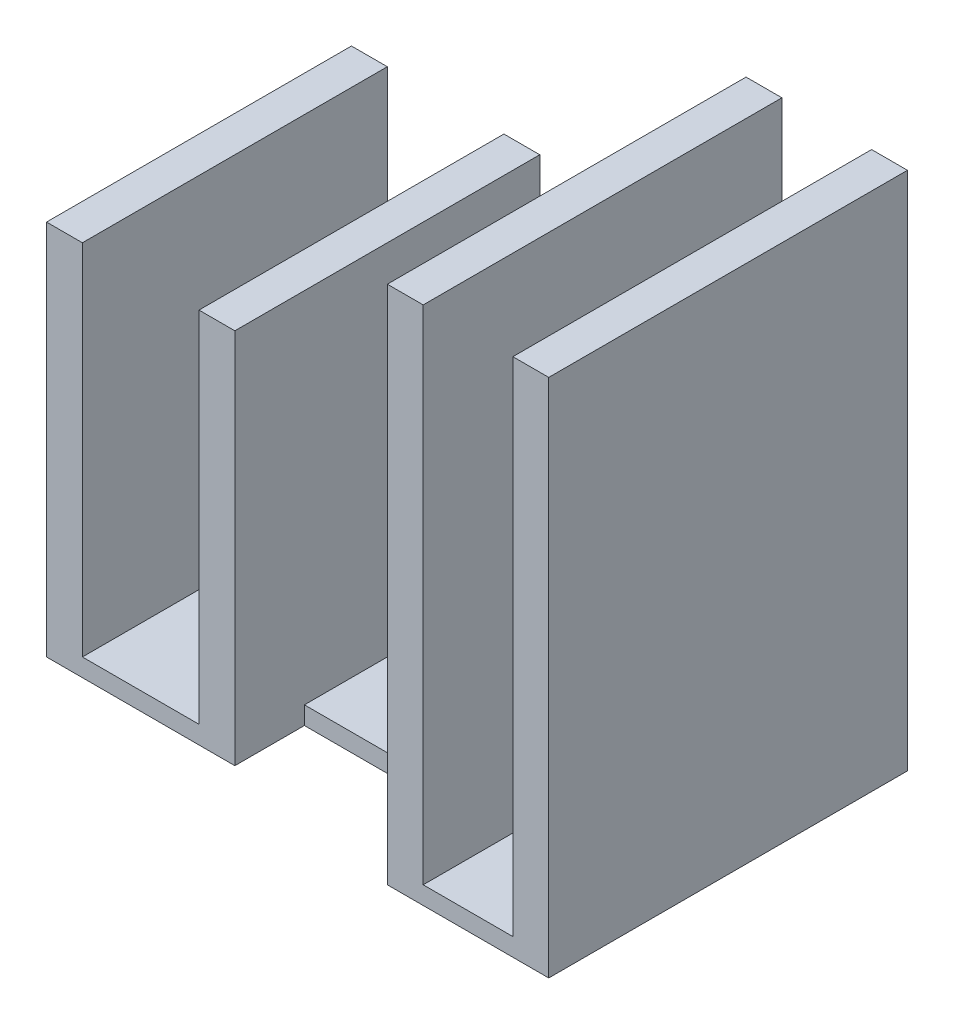
ISO-10303-21;
HEADER;
FILE_DESCRIPTION(('STEP AP214'),'2;1');
FILE_NAME('part.step','',(''),(''),'','','');
FILE_SCHEMA(('AUTOMOTIVE_DESIGN { 1 0 10303 214 1 1 1 1 }'));
ENDSEC;
DATA;
#1=APPLICATION_CONTEXT('core data for automotive mechanical design processes');
#2=APPLICATION_PROTOCOL_DEFINITION('international standard','automotive_design',2000,#1);
#3=PRODUCT_CONTEXT('',#1,'mechanical');
#4=PRODUCT('Part','Part','',(#3));
#5=PRODUCT_RELATED_PRODUCT_CATEGORY('part','',(#4));
#6=PRODUCT_DEFINITION_FORMATION('','',#4);
#7=PRODUCT_DEFINITION_CONTEXT('part definition',#1,'design');
#8=PRODUCT_DEFINITION('design','',#6,#7);
#9=PRODUCT_DEFINITION_SHAPE('','',#8);
#10=(LENGTH_UNIT() NAMED_UNIT(*) SI_UNIT(.MILLI.,.METRE.));
#11=(NAMED_UNIT(*) PLANE_ANGLE_UNIT() SI_UNIT($,.RADIAN.));
#12=(NAMED_UNIT(*) SI_UNIT($,.STERADIAN.) SOLID_ANGLE_UNIT());
#13=UNCERTAINTY_MEASURE_WITH_UNIT(LENGTH_MEASURE(1.E-05),#10,'distance_accuracy_value','');
#14=(GEOMETRIC_REPRESENTATION_CONTEXT(3) GLOBAL_UNCERTAINTY_ASSIGNED_CONTEXT((#13)) GLOBAL_UNIT_ASSIGNED_CONTEXT((#10,
#11,#12)) REPRESENTATION_CONTEXT('',''));
#15=CARTESIAN_POINT('',(0.,0.,0.));
#16=DIRECTION('',(0.,0.,1.));
#17=DIRECTION('',(1.,0.,0.));
#18=AXIS2_PLACEMENT_3D('',#15,#16,#17);
#19=CARTESIAN_POINT('',(0.,0.,0.));
#20=DIRECTION('',(0.,-1.,0.));
#21=DIRECTION('',(0.,0.,-1.));
#22=AXIS2_PLACEMENT_3D('',#19,#20,#21);
#23=PLANE('',#22);
#24=DIRECTION('',(1.,0.,0.));
#25=VECTOR('',#24,1.);
#26=CARTESIAN_POINT('',(0.,0.,4.62214276562588));
#27=LINE('',#26,#25);
#28=CARTESIAN_POINT('',(2.,0.,4.62214276562588));
#29=VERTEX_POINT('',#28);
#30=CARTESIAN_POINT('',(12.,0.,4.62214276562588));
#31=VERTEX_POINT('',#30);
#32=EDGE_CURVE('E264',#29,#31,#27,.T.);
#33=ORIENTED_EDGE('',*,*,#32,.T.);
#34=DIRECTION('',(0.,0.,-1.));
#35=VECTOR('',#34,1.);
#36=CARTESIAN_POINT('',(12.,0.,0.));
#37=LINE('',#36,#35);
#38=CARTESIAN_POINT('',(12.,0.,-3.51282850187557));
#39=VERTEX_POINT('',#38);
#40=EDGE_CURVE('E331',#31,#39,#37,.T.);
#41=ORIENTED_EDGE('',*,*,#40,.T.);
#42=DIRECTION('',(1.,0.,0.));
#43=VECTOR('',#42,1.);
#44=CARTESIAN_POINT('',(0.,0.,-3.51282850187557));
#45=LINE('',#44,#43);
#46=CARTESIAN_POINT('',(2.,0.,-3.51282850187557));
#47=VERTEX_POINT('',#46);
#48=EDGE_CURVE('E204',#47,#39,#45,.T.);
#49=ORIENTED_EDGE('',*,*,#48,.F.);
#50=DIRECTION('',(0.,0.,1.));
#51=VECTOR('',#50,1.);
#52=CARTESIAN_POINT('',(2.,0.,-8.5));
#53=LINE('',#52,#51);
#54=EDGE_CURVE('E298',#47,#29,#53,.T.);
#55=ORIENTED_EDGE('',*,*,#54,.T.);
#56=EDGE_LOOP('',(#33,#41,#49,#55));
#57=FACE_BOUND('',#56,.T.);
#58=ADVANCED_FACE('F81',(#57),#23,.F.);
#59=DIRECTION('',(0.,0.,1.));
#60=VECTOR('',#59,1.);
#61=CARTESIAN_POINT('',(0.,0.,-8.5));
#62=LINE('',#61,#60);
#63=CARTESIAN_POINT('',(0.,0.,-8.5));
#64=VERTEX_POINT('',#63);
#65=CARTESIAN_POINT('',(0.,0.,8.5));
#66=VERTEX_POINT('',#65);
#67=EDGE_CURVE('E182',#64,#66,#62,.T.);
#68=ORIENTED_EDGE('',*,*,#67,.F.);
#69=DIRECTION('',(-1.,0.,0.));
#70=VECTOR('',#69,1.);
#71=CARTESIAN_POINT('',(2.,0.,-8.5));
#72=LINE('',#71,#70);
#73=CARTESIAN_POINT('',(-6.5,0.,-8.5));
#74=VERTEX_POINT('',#73);
#75=EDGE_CURVE('E120',#64,#74,#72,.T.);
#76=ORIENTED_EDGE('',*,*,#75,.T.);
#77=DIRECTION('',(0.,0.,1.));
#78=VECTOR('',#77,1.);
#79=CARTESIAN_POINT('',(-6.5,0.,0.));
#80=LINE('',#79,#78);
#81=CARTESIAN_POINT('',(-6.5,0.,8.5));
#82=VERTEX_POINT('',#81);
#83=EDGE_CURVE('E170',#74,#82,#80,.T.);
#84=ORIENTED_EDGE('',*,*,#83,.T.);
#85=DIRECTION('',(-1.,0.,0.));
#86=VECTOR('',#85,1.);
#87=CARTESIAN_POINT('',(2.,0.,8.5));
#88=LINE('',#87,#86);
#89=EDGE_CURVE('E129',#66,#82,#88,.T.);
#90=ORIENTED_EDGE('',*,*,#89,.F.);
#91=EDGE_LOOP('',(#68,#76,#84,#90));
#92=FACE_BOUND('',#91,.T.);
#93=ADVANCED_FACE('F178',(#92),#23,.F.);
#94=DIRECTION('',(-1.,0.,0.));
#95=VECTOR('',#94,1.);
#96=CARTESIAN_POINT('',(0.,0.,-10.));
#97=LINE('',#96,#95);
#98=CARTESIAN_POINT('',(19.,0.,-10.));
#99=VERTEX_POINT('',#98);
#100=CARTESIAN_POINT('',(14.,0.,-10.));
#101=VERTEX_POINT('',#100);
#102=EDGE_CURVE('E272',#99,#101,#97,.T.);
#103=ORIENTED_EDGE('',*,*,#102,.T.);
#104=DIRECTION('',(0.,0.,1.));
#105=VECTOR('',#104,1.);
#106=CARTESIAN_POINT('',(14.,0.,-10.));
#107=LINE('',#106,#105);
#108=CARTESIAN_POINT('',(14.,0.,10.));
#109=VERTEX_POINT('',#108);
#110=EDGE_CURVE('E325',#101,#109,#107,.T.);
#111=ORIENTED_EDGE('',*,*,#110,.T.);
#112=DIRECTION('',(-1.,0.,0.));
#113=VECTOR('',#112,1.);
#114=CARTESIAN_POINT('',(0.,0.,10.));
#115=LINE('',#114,#113);
#116=CARTESIAN_POINT('',(19.,0.,10.));
#117=VERTEX_POINT('',#116);
#118=EDGE_CURVE('E268',#117,#109,#115,.T.);
#119=ORIENTED_EDGE('',*,*,#118,.F.);
#120=DIRECTION('',(0.,0.,1.));
#121=VECTOR('',#120,1.);
#122=CARTESIAN_POINT('',(19.,0.,0.));
#123=LINE('',#122,#121);
#124=EDGE_CURVE('E97',#99,#117,#123,.T.);
#125=ORIENTED_EDGE('',*,*,#124,.F.);
#126=EDGE_LOOP('',(#103,#111,#119,#125));
#127=FACE_BOUND('',#126,.T.);
#128=ADVANCED_FACE('F501',(#127),#23,.F.);
#129=CARTESIAN_POINT('',(0.,20.,-8.5));
#130=DIRECTION('',(0.,0.,1.));
#131=DIRECTION('',(1.,0.,0.));
#132=AXIS2_PLACEMENT_3D('',#129,#130,#131);
#133=PLANE('',#132);
#134=DIRECTION('',(0.,-1.,0.));
#135=VECTOR('',#134,1.);
#136=CARTESIAN_POINT('',(-6.5,20.,-8.5));
#137=LINE('',#136,#135);
#138=CARTESIAN_POINT('',(-6.5,20.,-8.5));
#139=VERTEX_POINT('',#138);
#140=EDGE_CURVE('E106',#139,#74,#137,.T.);
#141=ORIENTED_EDGE('',*,*,#140,.T.);
#142=ORIENTED_EDGE('',*,*,#75,.F.);
#143=DIRECTION('',(0.,-1.,0.));
#144=VECTOR('',#143,1.);
#145=CARTESIAN_POINT('',(0.,20.,-8.5));
#146=LINE('',#145,#144);
#147=CARTESIAN_POINT('',(0.,20.,-8.5));
#148=VERTEX_POINT('',#147);
#149=EDGE_CURVE('E321',#148,#64,#146,.T.);
#150=ORIENTED_EDGE('',*,*,#149,.F.);
#151=DIRECTION('',(1.,0.,0.));
#152=VECTOR('',#151,1.);
#153=CARTESIAN_POINT('',(0.,20.,-8.5));
#154=LINE('',#153,#152);
#155=CARTESIAN_POINT('',(2.,20.,-8.5));
#156=VERTEX_POINT('',#155);
#157=EDGE_CURVE('E299',#148,#156,#154,.T.);
#158=ORIENTED_EDGE('',*,*,#157,.T.);
#159=DIRECTION('',(0.,1.,0.));
#160=VECTOR('',#159,1.);
#161=CARTESIAN_POINT('',(2.,-1.,-8.5));
#162=LINE('',#161,#160);
#163=CARTESIAN_POINT('',(2.,-1.,-8.5));
#164=VERTEX_POINT('',#163);
#165=EDGE_CURVE('E201',#164,#156,#162,.T.);
#166=ORIENTED_EDGE('',*,*,#165,.F.);
#167=DIRECTION('',(-1.,0.,0.));
#168=VECTOR('',#167,1.);
#169=CARTESIAN_POINT('',(2.,-1.,-8.5));
#170=LINE('',#169,#168);
#171=CARTESIAN_POINT('',(-8.49999999999999,-1.,-8.5));
#172=VERTEX_POINT('',#171);
#173=EDGE_CURVE('E285',#164,#172,#170,.T.);
#174=ORIENTED_EDGE('',*,*,#173,.T.);
#175=DIRECTION('',(0.,-1.,0.));
#176=VECTOR('',#175,1.);
#177=CARTESIAN_POINT('',(-8.5,20.,-8.5));
#178=LINE('',#177,#176);
#179=CARTESIAN_POINT('',(-8.5,20.,-8.5));
#180=VERTEX_POINT('',#179);
#181=EDGE_CURVE('E12',#180,#172,#178,.T.);
#182=ORIENTED_EDGE('',*,*,#181,.F.);
#183=DIRECTION('',(-1.,0.,0.));
#184=VECTOR('',#183,1.);
#185=CARTESIAN_POINT('',(0.,20.,-8.5));
#186=LINE('',#185,#184);
#187=EDGE_CURVE('E147',#139,#180,#186,.T.);
#188=ORIENTED_EDGE('',*,*,#187,.F.);
#189=EDGE_LOOP('',(#141,#142,#150,#158,#166,#174,#182,#188));
#190=FACE_BOUND('',#189,.T.);
#191=ADVANCED_FACE('F83',(#190),#133,.F.);
#192=CARTESIAN_POINT('',(-8.5,20.,0.));
#193=DIRECTION('',(1.,0.,0.));
#194=DIRECTION('',(0.,0.,-1.));
#195=AXIS2_PLACEMENT_3D('',#192,#193,#194);
#196=PLANE('',#195);
#197=ORIENTED_EDGE('',*,*,#181,.T.);
#198=DIRECTION('',(0.,0.,1.));
#199=VECTOR('',#198,1.);
#200=CARTESIAN_POINT('',(-8.49999999999999,-1.,-8.5));
#201=LINE('',#200,#199);
#202=CARTESIAN_POINT('',(-8.49999999999999,-1.,8.5));
#203=VERTEX_POINT('',#202);
#204=EDGE_CURVE('E157',#172,#203,#201,.T.);
#205=ORIENTED_EDGE('',*,*,#204,.T.);
#206=DIRECTION('',(0.,-1.,0.));
#207=VECTOR('',#206,1.);
#208=CARTESIAN_POINT('',(-8.49999999999999,20.,8.5));
#209=LINE('',#208,#207);
#210=CARTESIAN_POINT('',(-8.49999999999999,20.,8.5));
#211=VERTEX_POINT('',#210);
#212=EDGE_CURVE('E90',#211,#203,#209,.T.);
#213=ORIENTED_EDGE('',*,*,#212,.F.);
#214=DIRECTION('',(0.,0.,1.));
#215=VECTOR('',#214,1.);
#216=CARTESIAN_POINT('',(-8.5,20.,0.));
#217=LINE('',#216,#215);
#218=EDGE_CURVE('E141',#180,#211,#217,.T.);
#219=ORIENTED_EDGE('',*,*,#218,.F.);
#220=EDGE_LOOP('',(#197,#205,#213,#219));
#221=FACE_BOUND('',#220,.T.);
#222=ADVANCED_FACE('F154',(#221),#196,.F.);
#223=CARTESIAN_POINT('',(0.,20.,8.5));
#224=DIRECTION('',(0.,0.,1.));
#225=DIRECTION('',(1.,0.,0.));
#226=AXIS2_PLACEMENT_3D('',#223,#224,#225);
#227=PLANE('',#226);
#228=ORIENTED_EDGE('',*,*,#212,.T.);
#229=DIRECTION('',(-1.,0.,0.));
#230=VECTOR('',#229,1.);
#231=CARTESIAN_POINT('',(2.,-1.,8.5));
#232=LINE('',#231,#230);
#233=CARTESIAN_POINT('',(2.,-1.,8.5));
#234=VERTEX_POINT('',#233);
#235=EDGE_CURVE('E189',#234,#203,#232,.T.);
#236=ORIENTED_EDGE('',*,*,#235,.F.);
#237=DIRECTION('',(0.,1.,0.));
#238=VECTOR('',#237,1.);
#239=CARTESIAN_POINT('',(2.,-1.,8.5));
#240=LINE('',#239,#238);
#241=CARTESIAN_POINT('',(1.99999999999999,20.,8.5));
#242=VERTEX_POINT('',#241);
#243=EDGE_CURVE('E197',#234,#242,#240,.T.);
#244=ORIENTED_EDGE('',*,*,#243,.T.);
#245=DIRECTION('',(1.,0.,0.));
#246=VECTOR('',#245,1.);
#247=CARTESIAN_POINT('',(0.,20.,8.5));
#248=LINE('',#247,#246);
#249=CARTESIAN_POINT('',(0.,20.,8.5));
#250=VERTEX_POINT('',#249);
#251=EDGE_CURVE('E307',#250,#242,#248,.T.);
#252=ORIENTED_EDGE('',*,*,#251,.F.);
#253=DIRECTION('',(0.,-1.,0.));
#254=VECTOR('',#253,1.);
#255=CARTESIAN_POINT('',(0.,20.,8.5));
#256=LINE('',#255,#254);
#257=EDGE_CURVE('E315',#250,#66,#256,.T.);
#258=ORIENTED_EDGE('',*,*,#257,.T.);
#259=ORIENTED_EDGE('',*,*,#89,.T.);
#260=DIRECTION('',(0.,-1.,0.));
#261=VECTOR('',#260,1.);
#262=CARTESIAN_POINT('',(-6.5,20.,8.5));
#263=LINE('',#262,#261);
#264=CARTESIAN_POINT('',(-6.5,20.,8.5));
#265=VERTEX_POINT('',#264);
#266=EDGE_CURVE('E161',#265,#82,#263,.T.);
#267=ORIENTED_EDGE('',*,*,#266,.F.);
#268=DIRECTION('',(-1.,0.,0.));
#269=VECTOR('',#268,1.);
#270=CARTESIAN_POINT('',(0.,20.,8.5));
#271=LINE('',#270,#269);
#272=EDGE_CURVE('E146',#265,#211,#271,.T.);
#273=ORIENTED_EDGE('',*,*,#272,.T.);
#274=EDGE_LOOP('',(#228,#236,#244,#252,#258,#259,#267,#273));
#275=FACE_BOUND('',#274,.T.);
#276=ADVANCED_FACE('F162',(#275),#227,.T.);
#277=CARTESIAN_POINT('',(-6.5,20.,0.));
#278=DIRECTION('',(1.,0.,0.));
#279=DIRECTION('',(0.,0.,-1.));
#280=AXIS2_PLACEMENT_3D('',#277,#278,#279);
#281=PLANE('',#280);
#282=ORIENTED_EDGE('',*,*,#83,.F.);
#283=ORIENTED_EDGE('',*,*,#140,.F.);
#284=DIRECTION('',(0.,0.,1.));
#285=VECTOR('',#284,1.);
#286=CARTESIAN_POINT('',(-6.5,20.,0.));
#287=LINE('',#286,#285);
#288=EDGE_CURVE('E164',#139,#265,#287,.T.);
#289=ORIENTED_EDGE('',*,*,#288,.T.);
#290=ORIENTED_EDGE('',*,*,#266,.T.);
#291=EDGE_LOOP('',(#282,#283,#289,#290));
#292=FACE_BOUND('',#291,.T.);
#293=ADVANCED_FACE('F177',(#292),#281,.T.);
#294=CARTESIAN_POINT('',(0.,20.,0.));
#295=DIRECTION('',(0.,1.,0.));
#296=DIRECTION('',(0.,0.,1.));
#297=AXIS2_PLACEMENT_3D('',#294,#295,#296);
#298=PLANE('',#297);
#299=ORIENTED_EDGE('',*,*,#187,.T.);
#300=ORIENTED_EDGE('',*,*,#218,.T.);
#301=ORIENTED_EDGE('',*,*,#272,.F.);
#302=ORIENTED_EDGE('',*,*,#288,.F.);
#303=EDGE_LOOP('',(#299,#300,#301,#302));
#304=FACE_BOUND('',#303,.T.);
#305=ADVANCED_FACE('F143',(#304),#298,.T.);
#306=CARTESIAN_POINT('',(0.,-1.,-3.51282850187557));
#307=DIRECTION('',(0.,0.,1.));
#308=DIRECTION('',(1.,0.,0.));
#309=AXIS2_PLACEMENT_3D('',#306,#307,#308);
#310=PLANE('',#309);
#311=ORIENTED_EDGE('',*,*,#48,.T.);
#312=DIRECTION('',(0.,1.,0.));
#313=VECTOR('',#312,1.);
#314=CARTESIAN_POINT('',(12.,-1.,-3.51282850187557));
#315=LINE('',#314,#313);
#316=CARTESIAN_POINT('',(12.,-1.,-3.51282850187557));
#317=VERTEX_POINT('',#316);
#318=EDGE_CURVE('E209',#317,#39,#315,.T.);
#319=ORIENTED_EDGE('',*,*,#318,.F.);
#320=DIRECTION('',(1.,0.,0.));
#321=VECTOR('',#320,1.);
#322=CARTESIAN_POINT('',(0.,-1.,-3.51282850187557));
#323=LINE('',#322,#321);
#324=CARTESIAN_POINT('',(2.,-1.,-3.51282850187557));
#325=VERTEX_POINT('',#324);
#326=EDGE_CURVE('E261',#325,#317,#323,.T.);
#327=ORIENTED_EDGE('',*,*,#326,.F.);
#328=DIRECTION('',(0.,1.,0.));
#329=VECTOR('',#328,1.);
#330=CARTESIAN_POINT('',(2.,-1.,-3.51282850187557));
#331=LINE('',#330,#329);
#332=EDGE_CURVE('E173',#325,#47,#331,.T.);
#333=ORIENTED_EDGE('',*,*,#332,.T.);
#334=EDGE_LOOP('',(#311,#319,#327,#333));
#335=FACE_BOUND('',#334,.T.);
#336=ADVANCED_FACE('F491',(#335),#310,.F.);
#337=CARTESIAN_POINT('',(12.,-1.,0.));
#338=DIRECTION('',(1.,0.,0.));
#339=DIRECTION('',(0.,0.,-1.));
#340=AXIS2_PLACEMENT_3D('',#337,#338,#339);
#341=PLANE('',#340);
#342=ORIENTED_EDGE('',*,*,#318,.T.);
#343=ORIENTED_EDGE('',*,*,#40,.F.);
#344=DIRECTION('',(0.,1.,0.));
#345=VECTOR('',#344,1.);
#346=CARTESIAN_POINT('',(12.,-1.,4.62214276562588));
#347=LINE('',#346,#345);
#348=CARTESIAN_POINT('',(12.,-1.,4.62214276562588));
#349=VERTEX_POINT('',#348);
#350=EDGE_CURVE('E229',#349,#31,#347,.T.);
#351=ORIENTED_EDGE('',*,*,#350,.F.);
#352=DIRECTION('',(0.,0.,-1.));
#353=VECTOR('',#352,1.);
#354=CARTESIAN_POINT('',(12.,-1.,0.));
#355=LINE('',#354,#353);
#356=CARTESIAN_POINT('',(12.,-1.,10.));
#357=VERTEX_POINT('',#356);
#358=EDGE_CURVE('E241',#357,#349,#355,.T.);
#359=ORIENTED_EDGE('',*,*,#358,.F.);
#360=DIRECTION('',(0.,1.,0.));
#361=VECTOR('',#360,1.);
#362=CARTESIAN_POINT('',(12.,-1.,10.));
#363=LINE('',#362,#361);
#364=CARTESIAN_POINT('',(12.,28.,10.));
#365=VERTEX_POINT('',#364);
#366=EDGE_CURVE('E225',#357,#365,#363,.T.);
#367=ORIENTED_EDGE('',*,*,#366,.T.);
#368=DIRECTION('',(0.,0.,1.));
#369=VECTOR('',#368,1.);
#370=CARTESIAN_POINT('',(12.,28.,-10.));
#371=LINE('',#370,#369);
#372=CARTESIAN_POINT('',(12.,28.,-10.));
#373=VERTEX_POINT('',#372);
#374=EDGE_CURVE('E355',#373,#365,#371,.T.);
#375=ORIENTED_EDGE('',*,*,#374,.F.);
#376=DIRECTION('',(0.,1.,0.));
#377=VECTOR('',#376,1.);
#378=CARTESIAN_POINT('',(12.,-1.,-10.));
#379=LINE('',#378,#377);
#380=CARTESIAN_POINT('',(12.,-1.,-10.));
#381=VERTEX_POINT('',#380);
#382=EDGE_CURVE('E213',#381,#373,#379,.T.);
#383=ORIENTED_EDGE('',*,*,#382,.F.);
#384=EDGE_CURVE('E247',#317,#381,#355,.T.);
#385=ORIENTED_EDGE('',*,*,#384,.F.);
#386=EDGE_LOOP('',(#342,#343,#351,#359,#367,#375,#383,#385));
#387=FACE_BOUND('',#386,.T.);
#388=ADVANCED_FACE('F419',(#387),#341,.F.);
#389=CARTESIAN_POINT('',(0.,-1.,-10.));
#390=DIRECTION('',(0.,0.,-1.));
#391=DIRECTION('',(-1.,0.,0.));
#392=AXIS2_PLACEMENT_3D('',#389,#390,#391);
#393=PLANE('',#392);
#394=ORIENTED_EDGE('',*,*,#102,.F.);
#395=DIRECTION('',(0.,-1.,0.));
#396=VECTOR('',#395,1.);
#397=CARTESIAN_POINT('',(19.,20.,-10.));
#398=LINE('',#397,#396);
#399=CARTESIAN_POINT('',(19.,28.,-10.));
#400=VERTEX_POINT('',#399);
#401=EDGE_CURVE('E295',#400,#99,#398,.T.);
#402=ORIENTED_EDGE('',*,*,#401,.F.);
#403=DIRECTION('',(-1.,0.,0.));
#404=VECTOR('',#403,1.);
#405=CARTESIAN_POINT('',(19.,28.,-10.));
#406=LINE('',#405,#404);
#407=CARTESIAN_POINT('',(21.,28.,-10.));
#408=VERTEX_POINT('',#407);
#409=EDGE_CURVE('E371',#408,#400,#406,.T.);
#410=ORIENTED_EDGE('',*,*,#409,.F.);
#411=DIRECTION('',(0.,1.,0.));
#412=VECTOR('',#411,1.);
#413=CARTESIAN_POINT('',(21.,-1.,-10.));
#414=LINE('',#413,#412);
#415=CARTESIAN_POINT('',(21.,-1.,-10.));
#416=VERTEX_POINT('',#415);
#417=EDGE_CURVE('E217',#416,#408,#414,.T.);
#418=ORIENTED_EDGE('',*,*,#417,.F.);
#419=DIRECTION('',(-1.,0.,0.));
#420=VECTOR('',#419,1.);
#421=CARTESIAN_POINT('',(0.,-1.,-10.));
#422=LINE('',#421,#420);
#423=EDGE_CURVE('E254',#416,#381,#422,.T.);
#424=ORIENTED_EDGE('',*,*,#423,.T.);
#425=ORIENTED_EDGE('',*,*,#382,.T.);
#426=DIRECTION('',(-1.,0.,0.));
#427=VECTOR('',#426,1.);
#428=CARTESIAN_POINT('',(12.,28.,-10.));
#429=LINE('',#428,#427);
#430=CARTESIAN_POINT('',(14.,28.,-10.));
#431=VERTEX_POINT('',#430);
#432=EDGE_CURVE('E340',#431,#373,#429,.T.);
#433=ORIENTED_EDGE('',*,*,#432,.F.);
#434=DIRECTION('',(0.,-1.,0.));
#435=VECTOR('',#434,1.);
#436=CARTESIAN_POINT('',(14.,20.,-10.));
#437=LINE('',#436,#435);
#438=EDGE_CURVE('E335',#431,#101,#437,.T.);
#439=ORIENTED_EDGE('',*,*,#438,.T.);
#440=EDGE_LOOP('',(#394,#402,#410,#418,#424,#425,#433,#439));
#441=FACE_BOUND('',#440,.T.);
#442=ADVANCED_FACE('F406',(#441),#393,.T.);
#443=CARTESIAN_POINT('',(21.,-1.,0.));
#444=DIRECTION('',(1.,0.,0.));
#445=DIRECTION('',(0.,0.,-1.));
#446=AXIS2_PLACEMENT_3D('',#443,#444,#445);
#447=PLANE('',#446);
#448=ORIENTED_EDGE('',*,*,#417,.T.);
#449=DIRECTION('',(0.,0.,-1.));
#450=VECTOR('',#449,1.);
#451=CARTESIAN_POINT('',(21.,28.,10.));
#452=LINE('',#451,#450);
#453=CARTESIAN_POINT('',(21.,28.,10.));
#454=VERTEX_POINT('',#453);
#455=EDGE_CURVE('E367',#454,#408,#452,.T.);
#456=ORIENTED_EDGE('',*,*,#455,.F.);
#457=DIRECTION('',(0.,1.,0.));
#458=VECTOR('',#457,1.);
#459=CARTESIAN_POINT('',(21.,-1.,10.));
#460=LINE('',#459,#458);
#461=CARTESIAN_POINT('',(21.,-1.,10.));
#462=VERTEX_POINT('',#461);
#463=EDGE_CURVE('E221',#462,#454,#460,.T.);
#464=ORIENTED_EDGE('',*,*,#463,.F.);
#465=DIRECTION('',(0.,0.,-1.));
#466=VECTOR('',#465,1.);
#467=CARTESIAN_POINT('',(21.,-1.,0.));
#468=LINE('',#467,#466);
#469=EDGE_CURVE('E250',#462,#416,#468,.T.);
#470=ORIENTED_EDGE('',*,*,#469,.T.);
#471=EDGE_LOOP('',(#448,#456,#464,#470));
#472=FACE_BOUND('',#471,.T.);
#473=ADVANCED_FACE('F399',(#472),#447,.T.);
#474=CARTESIAN_POINT('',(0.,-1.,10.));
#475=DIRECTION('',(0.,0.,-1.));
#476=DIRECTION('',(-1.,0.,0.));
#477=AXIS2_PLACEMENT_3D('',#474,#475,#476);
#478=PLANE('',#477);
#479=ORIENTED_EDGE('',*,*,#463,.T.);
#480=DIRECTION('',(1.,0.,0.));
#481=VECTOR('',#480,1.);
#482=CARTESIAN_POINT('',(19.,28.,10.));
#483=LINE('',#482,#481);
#484=CARTESIAN_POINT('',(19.,28.,10.));
#485=VERTEX_POINT('',#484);
#486=EDGE_CURVE('E363',#485,#454,#483,.T.);
#487=ORIENTED_EDGE('',*,*,#486,.F.);
#488=DIRECTION('',(0.,-1.,0.));
#489=VECTOR('',#488,1.);
#490=CARTESIAN_POINT('',(19.,20.,10.));
#491=LINE('',#490,#489);
#492=EDGE_CURVE('E191',#485,#117,#491,.T.);
#493=ORIENTED_EDGE('',*,*,#492,.T.);
#494=ORIENTED_EDGE('',*,*,#118,.T.);
#495=DIRECTION('',(0.,-1.,0.));
#496=VECTOR('',#495,1.);
#497=CARTESIAN_POINT('',(14.,20.,10.));
#498=LINE('',#497,#496);
#499=CARTESIAN_POINT('',(14.,28.,10.));
#500=VERTEX_POINT('',#499);
#501=EDGE_CURVE('E336',#500,#109,#498,.T.);
#502=ORIENTED_EDGE('',*,*,#501,.F.);
#503=DIRECTION('',(1.,0.,0.));
#504=VECTOR('',#503,1.);
#505=CARTESIAN_POINT('',(12.,28.,10.));
#506=LINE('',#505,#504);
#507=EDGE_CURVE('E351',#365,#500,#506,.T.);
#508=ORIENTED_EDGE('',*,*,#507,.F.);
#509=ORIENTED_EDGE('',*,*,#366,.F.);
#510=DIRECTION('',(-1.,0.,0.));
#511=VECTOR('',#510,1.);
#512=CARTESIAN_POINT('',(0.,-1.,10.));
#513=LINE('',#512,#511);
#514=EDGE_CURVE('E245',#462,#357,#513,.T.);
#515=ORIENTED_EDGE('',*,*,#514,.F.);
#516=EDGE_LOOP('',(#479,#487,#493,#494,#502,#508,#509,#515));
#517=FACE_BOUND('',#516,.T.);
#518=ADVANCED_FACE('F394',(#517),#478,.F.);
#519=CARTESIAN_POINT('',(0.,-1.,4.62214276562588));
#520=DIRECTION('',(0.,0.,1.));
#521=DIRECTION('',(1.,0.,0.));
#522=AXIS2_PLACEMENT_3D('',#519,#520,#521);
#523=PLANE('',#522);
#524=ORIENTED_EDGE('',*,*,#32,.F.);
#525=DIRECTION('',(0.,1.,0.));
#526=VECTOR('',#525,1.);
#527=CARTESIAN_POINT('',(2.,-1.,4.62214276562588));
#528=LINE('',#527,#526);
#529=CARTESIAN_POINT('',(2.,-1.,4.62214276562588));
#530=VERTEX_POINT('',#529);
#531=EDGE_CURVE('E233',#530,#29,#528,.T.);
#532=ORIENTED_EDGE('',*,*,#531,.F.);
#533=DIRECTION('',(1.,0.,0.));
#534=VECTOR('',#533,1.);
#535=CARTESIAN_POINT('',(0.,-1.,4.62214276562588));
#536=LINE('',#535,#534);
#537=EDGE_CURVE('E237',#530,#349,#536,.T.);
#538=ORIENTED_EDGE('',*,*,#537,.T.);
#539=ORIENTED_EDGE('',*,*,#350,.T.);
#540=EDGE_LOOP('',(#524,#532,#538,#539));
#541=FACE_BOUND('',#540,.T.);
#542=ADVANCED_FACE('F498',(#541),#523,.T.);
#543=CARTESIAN_POINT('',(0.,-1.,0.));
#544=DIRECTION('',(0.,-1.,0.));
#545=DIRECTION('',(0.,0.,-1.));
#546=AXIS2_PLACEMENT_3D('',#543,#544,#545);
#547=PLANE('',#546);
#548=ORIENTED_EDGE('',*,*,#537,.F.);
#549=DIRECTION('',(0.,0.,1.));
#550=VECTOR('',#549,1.);
#551=CARTESIAN_POINT('',(2.,-1.,-8.5));
#552=LINE('',#551,#550);
#553=EDGE_CURVE('E282',#530,#234,#552,.T.);
#554=ORIENTED_EDGE('',*,*,#553,.T.);
#555=ORIENTED_EDGE('',*,*,#235,.T.);
#556=ORIENTED_EDGE('',*,*,#204,.F.);
#557=ORIENTED_EDGE('',*,*,#173,.F.);
#558=EDGE_CURVE('E194',#164,#325,#552,.T.);
#559=ORIENTED_EDGE('',*,*,#558,.T.);
#560=ORIENTED_EDGE('',*,*,#326,.T.);
#561=ORIENTED_EDGE('',*,*,#384,.T.);
#562=ORIENTED_EDGE('',*,*,#423,.F.);
#563=ORIENTED_EDGE('',*,*,#469,.F.);
#564=ORIENTED_EDGE('',*,*,#514,.T.);
#565=ORIENTED_EDGE('',*,*,#358,.T.);
#566=EDGE_LOOP('',(#548,#554,#555,#556,#557,#559,#560,#561,#562,#563,#564,#565));
#567=FACE_BOUND('',#566,.T.);
#568=ADVANCED_FACE('F410',(#567),#547,.T.);
#569=CARTESIAN_POINT('',(2.,-1.,-8.5));
#570=DIRECTION('',(-1.,0.,0.));
#571=DIRECTION('',(0.,0.,1.));
#572=AXIS2_PLACEMENT_3D('',#569,#570,#571);
#573=PLANE('',#572);
#574=ORIENTED_EDGE('',*,*,#553,.F.);
#575=ORIENTED_EDGE('',*,*,#531,.T.);
#576=ORIENTED_EDGE('',*,*,#54,.F.);
#577=ORIENTED_EDGE('',*,*,#332,.F.);
#578=ORIENTED_EDGE('',*,*,#558,.F.);
#579=ORIENTED_EDGE('',*,*,#165,.T.);
#580=DIRECTION('',(0.,0.,1.));
#581=VECTOR('',#580,1.);
#582=CARTESIAN_POINT('',(2.,20.,-8.5));
#583=LINE('',#582,#581);
#584=EDGE_CURVE('E303',#156,#242,#583,.T.);
#585=ORIENTED_EDGE('',*,*,#584,.T.);
#586=ORIENTED_EDGE('',*,*,#243,.F.);
#587=EDGE_LOOP('',(#574,#575,#576,#577,#578,#579,#585,#586));
#588=FACE_BOUND('',#587,.T.);
#589=ADVANCED_FACE('F479',(#588),#573,.F.);
#590=CARTESIAN_POINT('',(19.,20.,0.));
#591=DIRECTION('',(1.,0.,0.));
#592=DIRECTION('',(0.,0.,-1.));
#593=AXIS2_PLACEMENT_3D('',#590,#591,#592);
#594=PLANE('',#593);
#595=ORIENTED_EDGE('',*,*,#124,.T.);
#596=ORIENTED_EDGE('',*,*,#492,.F.);
#597=DIRECTION('',(0.,0.,1.));
#598=VECTOR('',#597,1.);
#599=CARTESIAN_POINT('',(19.,28.,10.));
#600=LINE('',#599,#598);
#601=EDGE_CURVE('E359',#400,#485,#600,.T.);
#602=ORIENTED_EDGE('',*,*,#601,.F.);
#603=ORIENTED_EDGE('',*,*,#401,.T.);
#604=EDGE_LOOP('',(#595,#596,#602,#603));
#605=FACE_BOUND('',#604,.T.);
#606=ADVANCED_FACE('F386',(#605),#594,.F.);
#607=CARTESIAN_POINT('',(0.,20.,-8.5));
#608=DIRECTION('',(1.,0.,0.));
#609=DIRECTION('',(0.,0.,-1.));
#610=AXIS2_PLACEMENT_3D('',#607,#608,#609);
#611=PLANE('',#610);
#612=ORIENTED_EDGE('',*,*,#67,.T.);
#613=ORIENTED_EDGE('',*,*,#257,.F.);
#614=DIRECTION('',(0.,0.,1.));
#615=VECTOR('',#614,1.);
#616=CARTESIAN_POINT('',(0.,20.,-8.5));
#617=LINE('',#616,#615);
#618=EDGE_CURVE('E311',#148,#250,#617,.T.);
#619=ORIENTED_EDGE('',*,*,#618,.F.);
#620=ORIENTED_EDGE('',*,*,#149,.T.);
#621=EDGE_LOOP('',(#612,#613,#619,#620));
#622=FACE_BOUND('',#621,.T.);
#623=ADVANCED_FACE('F488',(#622),#611,.F.);
#624=CARTESIAN_POINT('',(0.,20.,0.));
#625=DIRECTION('',(0.,-1.,0.));
#626=DIRECTION('',(0.,0.,-1.));
#627=AXIS2_PLACEMENT_3D('',#624,#625,#626);
#628=PLANE('',#627);
#629=ORIENTED_EDGE('',*,*,#157,.F.);
#630=ORIENTED_EDGE('',*,*,#618,.T.);
#631=ORIENTED_EDGE('',*,*,#251,.T.);
#632=ORIENTED_EDGE('',*,*,#584,.F.);
#633=EDGE_LOOP('',(#629,#630,#631,#632));
#634=FACE_BOUND('',#633,.T.);
#635=ADVANCED_FACE('F484',(#634),#628,.F.);
#636=CARTESIAN_POINT('',(14.,20.,-10.));
#637=DIRECTION('',(1.,0.,0.));
#638=DIRECTION('',(0.,0.,-1.));
#639=AXIS2_PLACEMENT_3D('',#636,#637,#638);
#640=PLANE('',#639);
#641=ORIENTED_EDGE('',*,*,#110,.F.);
#642=ORIENTED_EDGE('',*,*,#438,.F.);
#643=DIRECTION('',(0.,0.,-1.));
#644=VECTOR('',#643,1.);
#645=CARTESIAN_POINT('',(14.,28.,-10.));
#646=LINE('',#645,#644);
#647=EDGE_CURVE('E347',#500,#431,#646,.T.);
#648=ORIENTED_EDGE('',*,*,#647,.F.);
#649=ORIENTED_EDGE('',*,*,#501,.T.);
#650=EDGE_LOOP('',(#641,#642,#648,#649));
#651=FACE_BOUND('',#650,.T.);
#652=ADVANCED_FACE('F434',(#651),#640,.T.);
#653=CARTESIAN_POINT('',(0.,28.,0.));
#654=DIRECTION('',(0.,1.,0.));
#655=DIRECTION('',(0.,0.,1.));
#656=AXIS2_PLACEMENT_3D('',#653,#654,#655);
#657=PLANE('',#656);
#658=ORIENTED_EDGE('',*,*,#374,.T.);
#659=ORIENTED_EDGE('',*,*,#507,.T.);
#660=ORIENTED_EDGE('',*,*,#647,.T.);
#661=ORIENTED_EDGE('',*,*,#432,.T.);
#662=EDGE_LOOP('',(#658,#659,#660,#661));
#663=FACE_BOUND('',#662,.T.);
#664=ADVANCED_FACE('F426',(#663),#657,.T.);
#665=CARTESIAN_POINT('',(0.,28.,0.));
#666=DIRECTION('',(0.,-1.,0.));
#667=DIRECTION('',(0.,0.,-1.));
#668=AXIS2_PLACEMENT_3D('',#665,#666,#667);
#669=PLANE('',#668);
#670=ORIENTED_EDGE('',*,*,#601,.T.);
#671=ORIENTED_EDGE('',*,*,#486,.T.);
#672=ORIENTED_EDGE('',*,*,#455,.T.);
#673=ORIENTED_EDGE('',*,*,#409,.T.);
#674=EDGE_LOOP('',(#670,#671,#672,#673));
#675=FACE_BOUND('',#674,.T.);
#676=ADVANCED_FACE('F378',(#675),#669,.F.);
#677=CLOSED_SHELL('',(#58,#93,#128,#191,#222,#276,#293,#305,#336,#388,#442,#473,#518,#542,#568,
#589,#606,#623,#635,#652,#664,#676));
#678=MANIFOLD_SOLID_BREP('B2',#677);
#679=ADVANCED_BREP_SHAPE_REPRESENTATION('',(#18,#678),#14);
#680=SHAPE_DEFINITION_REPRESENTATION(#9,#679);
ENDSEC;
END-ISO-10303-21;
